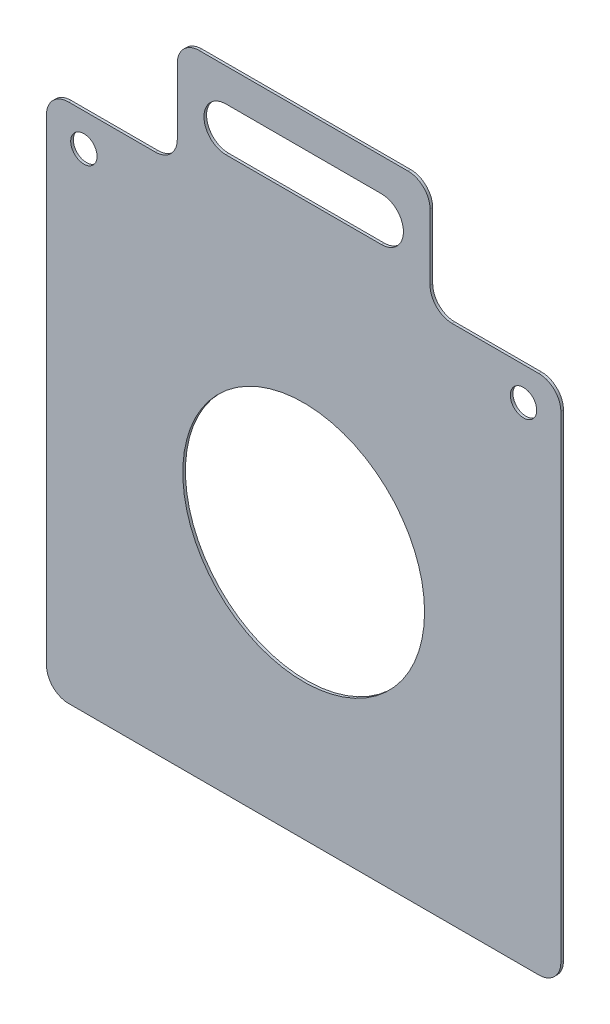
ISO-10303-21;
HEADER;
FILE_DESCRIPTION(('STEP AP214'),'2;1');
FILE_NAME('part.step','',(''),(''),'','','');
FILE_SCHEMA(('AUTOMOTIVE_DESIGN { 1 0 10303 214 1 1 1 1 }'));
ENDSEC;
DATA;
#1=APPLICATION_CONTEXT('core data for automotive mechanical design processes');
#2=APPLICATION_PROTOCOL_DEFINITION('international standard','automotive_design',2000,#1);
#3=PRODUCT_CONTEXT('',#1,'mechanical');
#4=PRODUCT('Part','Part','',(#3));
#5=PRODUCT_RELATED_PRODUCT_CATEGORY('part','',(#4));
#6=PRODUCT_DEFINITION_FORMATION('','',#4);
#7=PRODUCT_DEFINITION_CONTEXT('part definition',#1,'design');
#8=PRODUCT_DEFINITION('design','',#6,#7);
#9=PRODUCT_DEFINITION_SHAPE('','',#8);
#10=(LENGTH_UNIT() NAMED_UNIT(*) SI_UNIT(.MILLI.,.METRE.));
#11=(NAMED_UNIT(*) PLANE_ANGLE_UNIT() SI_UNIT($,.RADIAN.));
#12=(NAMED_UNIT(*) SI_UNIT($,.STERADIAN.) SOLID_ANGLE_UNIT());
#13=UNCERTAINTY_MEASURE_WITH_UNIT(LENGTH_MEASURE(1.E-05),#10,'distance_accuracy_value','');
#14=(GEOMETRIC_REPRESENTATION_CONTEXT(3) GLOBAL_UNCERTAINTY_ASSIGNED_CONTEXT((#13)) GLOBAL_UNIT_ASSIGNED_CONTEXT((#10,
#11,#12)) REPRESENTATION_CONTEXT('',''));
#15=CARTESIAN_POINT('',(0.,0.,0.));
#16=DIRECTION('',(0.,0.,1.));
#17=DIRECTION('',(1.,0.,0.));
#18=AXIS2_PLACEMENT_3D('',#15,#16,#17);
#19=CARTESIAN_POINT('',(-117.,120.,1.20000000000002));
#20=DIRECTION('',(0.,-1.,0.));
#21=DIRECTION('',(1.,0.,0.));
#22=AXIS2_PLACEMENT_3D('',#19,#20,#21);
#23=PLANE('',#22);
#24=DIRECTION('',(-1.,0.,0.));
#25=VECTOR('',#24,1.);
#26=CARTESIAN_POINT('',(-117.,120.,1.20000000000002));
#27=LINE('',#26,#25);
#28=CARTESIAN_POINT('',(-67.5000000000001,120.,1.20000000000002));
#29=VERTEX_POINT('',#28);
#30=CARTESIAN_POINT('',(-107.,120.,1.20000000000002));
#31=VERTEX_POINT('',#30);
#32=EDGE_CURVE('E276',#29,#31,#27,.T.);
#33=ORIENTED_EDGE('',*,*,#32,.F.);
#34=DIRECTION('',(0.,0.,1.));
#35=VECTOR('',#34,1.);
#36=CARTESIAN_POINT('',(-67.5000000000001,120.,1.20000000000002));
#37=LINE('',#36,#35);
#38=CARTESIAN_POINT('',(-67.5000000000001,120.,0.));
#39=VERTEX_POINT('',#38);
#40=EDGE_CURVE('E361',#29,#39,#37,.F.);
#41=ORIENTED_EDGE('',*,*,#40,.T.);
#42=DIRECTION('',(-1.,0.,0.));
#43=VECTOR('',#42,1.);
#44=CARTESIAN_POINT('',(-117.,120.,0.));
#45=LINE('',#44,#43);
#46=CARTESIAN_POINT('',(-107.,120.,0.));
#47=VERTEX_POINT('',#46);
#48=EDGE_CURVE('E291',#39,#47,#45,.T.);
#49=ORIENTED_EDGE('',*,*,#48,.T.);
#50=DIRECTION('',(0.,0.,-1.));
#51=VECTOR('',#50,1.);
#52=CARTESIAN_POINT('',(-107.,120.,1.20000000000002));
#53=LINE('',#52,#51);
#54=EDGE_CURVE('E358',#47,#31,#53,.F.);
#55=ORIENTED_EDGE('',*,*,#54,.T.);
#56=EDGE_LOOP('',(#33,#41,#49,#55));
#57=FACE_BOUND('',#56,.T.);
#58=ADVANCED_FACE('F40',(#57),#23,.F.);
#59=CARTESIAN_POINT('',(0.,0.,1.20000000000001));
#60=DIRECTION('',(0.,0.,1.));
#61=DIRECTION('',(1.,0.,0.));
#62=AXIS2_PLACEMENT_3D('',#59,#60,#61);
#63=PLANE('',#62);
#64=CARTESIAN_POINT('',(-100.,105.,1.20000000000002));
#65=DIRECTION('',(0.,0.,1.));
#66=DIRECTION('',(1.,0.,0.));
#67=AXIS2_PLACEMENT_3D('',#64,#65,#66);
#68=CIRCLE('',#67,6.);
#69=CARTESIAN_POINT('',(-94.0000000000003,105.,1.20000000000002));
#70=VERTEX_POINT('',#69);
#71=EDGE_CURVE('E247',#70,#70,#68,.T.);
#72=ORIENTED_EDGE('',*,*,#71,.F.);
#73=EDGE_LOOP('',(#72));
#74=FACE_BOUND('',#73,.T.);
#75=DIRECTION('',(0.,1.,0.));
#76=VECTOR('',#75,1.);
#77=CARTESIAN_POINT('',(57.5000000000002,170.000000000002,1.20000000000003));
#78=LINE('',#77,#76);
#79=CARTESIAN_POINT('',(57.5000000000002,130.000000000001,1.20000000000003));
#80=VERTEX_POINT('',#79);
#81=CARTESIAN_POINT('',(57.5000000000001,160.000000000002,1.20000000000003));
#82=VERTEX_POINT('',#81);
#83=EDGE_CURVE('E217',#80,#82,#78,.T.);
#84=ORIENTED_EDGE('',*,*,#83,.T.);
#85=CARTESIAN_POINT('',(47.5,160.000000000002,1.20000000000003));
#86=DIRECTION('',(0.,0.,1.));
#87=DIRECTION('',(1.,0.,0.));
#88=AXIS2_PLACEMENT_3D('',#85,#86,#87);
#89=CIRCLE('',#88,10.);
#90=CARTESIAN_POINT('',(47.5000000000002,170.000000000002,1.20000000000003));
#91=VERTEX_POINT('',#90);
#92=EDGE_CURVE('E325',#82,#91,#89,.T.);
#93=ORIENTED_EDGE('',*,*,#92,.T.);
#94=DIRECTION('',(-1.,0.,0.));
#95=VECTOR('',#94,1.);
#96=CARTESIAN_POINT('',(-57.5,170.000000000002,1.20000000000002));
#97=LINE('',#96,#95);
#98=CARTESIAN_POINT('',(-47.5000000000002,170.000000000002,1.20000000000002));
#99=VERTEX_POINT('',#98);
#100=EDGE_CURVE('E225',#91,#99,#97,.T.);
#101=ORIENTED_EDGE('',*,*,#100,.T.);
#102=CARTESIAN_POINT('',(-47.5,160.000000000002,1.20000000000003));
#103=DIRECTION('',(0.,0.,1.));
#104=DIRECTION('',(1.,0.,0.));
#105=AXIS2_PLACEMENT_3D('',#102,#103,#104);
#106=CIRCLE('',#105,10.);
#107=CARTESIAN_POINT('',(-57.5000000000002,160.000000000002,1.20000000000002));
#108=VERTEX_POINT('',#107);
#109=EDGE_CURVE('E322',#99,#108,#106,.T.);
#110=ORIENTED_EDGE('',*,*,#109,.T.);
#111=DIRECTION('',(0.,-1.,0.));
#112=VECTOR('',#111,1.);
#113=CARTESIAN_POINT('',(-57.5,120.000000000002,1.20000000000002));
#114=LINE('',#113,#112);
#115=CARTESIAN_POINT('',(-57.5000000000002,130.,1.20000000000001));
#116=VERTEX_POINT('',#115);
#117=EDGE_CURVE('E229',#108,#116,#114,.T.);
#118=ORIENTED_EDGE('',*,*,#117,.T.);
#119=CARTESIAN_POINT('',(-67.5000000000001,130.,1.20000000000001));
#120=DIRECTION('',(0.,0.,1.));
#121=DIRECTION('',(1.,0.,0.));
#122=AXIS2_PLACEMENT_3D('',#119,#120,#121);
#123=CIRCLE('',#122,10.);
#124=EDGE_CURVE('E49',#116,#29,#123,.F.);
#125=ORIENTED_EDGE('',*,*,#124,.T.);
#126=ORIENTED_EDGE('',*,*,#32,.T.);
#127=CARTESIAN_POINT('',(-107.,110.,1.20000000000002));
#128=DIRECTION('',(0.,0.,1.));
#129=DIRECTION('',(1.,0.,0.));
#130=AXIS2_PLACEMENT_3D('',#127,#128,#129);
#131=CIRCLE('',#130,10.);
#132=CARTESIAN_POINT('',(-117.,110.,1.20000000000002));
#133=VERTEX_POINT('',#132);
#134=EDGE_CURVE('E319',#31,#133,#131,.T.);
#135=ORIENTED_EDGE('',*,*,#134,.T.);
#136=DIRECTION('',(0.,-1.,0.));
#137=VECTOR('',#136,1.);
#138=CARTESIAN_POINT('',(-117.,120.,1.20000000000002));
#139=LINE('',#138,#137);
#140=CARTESIAN_POINT('',(-117.,-107.,1.19999999999999));
#141=VERTEX_POINT('',#140);
#142=EDGE_CURVE('E263',#133,#141,#139,.T.);
#143=ORIENTED_EDGE('',*,*,#142,.T.);
#144=CARTESIAN_POINT('',(-107.,-107.,1.19999999999999));
#145=DIRECTION('',(0.,0.,1.));
#146=DIRECTION('',(1.,0.,0.));
#147=AXIS2_PLACEMENT_3D('',#144,#145,#146);
#148=CIRCLE('',#147,10.);
#149=CARTESIAN_POINT('',(-107.,-117.,1.19999999999999));
#150=VERTEX_POINT('',#149);
#151=EDGE_CURVE('E313',#141,#150,#148,.T.);
#152=ORIENTED_EDGE('',*,*,#151,.T.);
#153=DIRECTION('',(1.,0.,0.));
#154=VECTOR('',#153,1.);
#155=CARTESIAN_POINT('',(-117.,-117.,1.19999999999999));
#156=LINE('',#155,#154);
#157=CARTESIAN_POINT('',(107.,-117.,1.20000000000001));
#158=VERTEX_POINT('',#157);
#159=EDGE_CURVE('E267',#150,#158,#156,.T.);
#160=ORIENTED_EDGE('',*,*,#159,.T.);
#161=CARTESIAN_POINT('',(107.,-107.,1.20000000000001));
#162=DIRECTION('',(0.,0.,1.));
#163=DIRECTION('',(1.,0.,0.));
#164=AXIS2_PLACEMENT_3D('',#161,#162,#163);
#165=CIRCLE('',#164,10.);
#166=CARTESIAN_POINT('',(117.,-107.,1.20000000000001));
#167=VERTEX_POINT('',#166);
#168=EDGE_CURVE('E316',#158,#167,#165,.T.);
#169=ORIENTED_EDGE('',*,*,#168,.T.);
#170=DIRECTION('',(0.,1.,0.));
#171=VECTOR('',#170,1.);
#172=CARTESIAN_POINT('',(117.,120.,1.20000000000001));
#173=LINE('',#172,#171);
#174=CARTESIAN_POINT('',(117.,110.,1.20000000000001));
#175=VERTEX_POINT('',#174);
#176=EDGE_CURVE('E272',#167,#175,#173,.T.);
#177=ORIENTED_EDGE('',*,*,#176,.T.);
#178=CARTESIAN_POINT('',(107.,110.,1.20000000000001));
#179=DIRECTION('',(0.,0.,1.));
#180=DIRECTION('',(1.,0.,0.));
#181=AXIS2_PLACEMENT_3D('',#178,#179,#180);
#182=CIRCLE('',#181,10.);
#183=CARTESIAN_POINT('',(107.,120.,1.20000000000001));
#184=VERTEX_POINT('',#183);
#185=EDGE_CURVE('E310',#175,#184,#182,.T.);
#186=ORIENTED_EDGE('',*,*,#185,.T.);
#187=CARTESIAN_POINT('',(67.5,120.000000000001,1.20000000000001));
#188=VERTEX_POINT('',#187);
#189=EDGE_CURVE('E280',#184,#188,#27,.T.);
#190=ORIENTED_EDGE('',*,*,#189,.T.);
#191=CARTESIAN_POINT('',(67.5000000000002,130.000000000001,1.20000000000001));
#192=DIRECTION('',(0.,0.,1.));
#193=DIRECTION('',(1.,0.,0.));
#194=AXIS2_PLACEMENT_3D('',#191,#192,#193);
#195=CIRCLE('',#194,10.);
#196=EDGE_CURVE('E384',#188,#80,#195,.F.);
#197=ORIENTED_EDGE('',*,*,#196,.T.);
#198=EDGE_LOOP('',(#84,#93,#101,#110,#118,#125,#126,#135,#143,#152,#160,#169,#177,#186,#190,#197));
#199=FACE_BOUND('',#198,.T.);
#200=CARTESIAN_POINT('',(0.,0.,1.20000000000001));
#201=DIRECTION('',(0.,0.,1.));
#202=DIRECTION('',(1.,0.,0.));
#203=AXIS2_PLACEMENT_3D('',#200,#201,#202);
#204=CIRCLE('',#203,55.);
#205=CARTESIAN_POINT('',(55.0000000000001,0.,1.20000000000001));
#206=VERTEX_POINT('',#205);
#207=EDGE_CURVE('E255',#206,#206,#204,.T.);
#208=ORIENTED_EDGE('',*,*,#207,.F.);
#209=EDGE_LOOP('',(#208));
#210=FACE_BOUND('',#209,.T.);
#211=CARTESIAN_POINT('',(100.,105.,1.20000000000001));
#212=DIRECTION('',(0.,0.,1.));
#213=DIRECTION('',(-1.,0.,0.));
#214=AXIS2_PLACEMENT_3D('',#211,#212,#213);
#215=CIRCLE('',#214,6.);
#216=CARTESIAN_POINT('',(94.0000000000001,105.,1.20000000000001));
#217=VERTEX_POINT('',#216);
#218=EDGE_CURVE('E237',#217,#217,#215,.T.);
#219=ORIENTED_EDGE('',*,*,#218,.F.);
#220=EDGE_LOOP('',(#219));
#221=FACE_BOUND('',#220,.T.);
#222=DIRECTION('',(1.,0.,0.));
#223=VECTOR('',#222,1.);
#224=CARTESIAN_POINT('',(-35.3706002300002,134.999999999999,1.20000000000002));
#225=LINE('',#224,#223);
#226=CARTESIAN_POINT('',(-35.3706002300002,134.999999999999,1.20000000000002));
#227=VERTEX_POINT('',#226);
#228=CARTESIAN_POINT('',(35.3706002300002,135.,1.20000000000001));
#229=VERTEX_POINT('',#228);
#230=EDGE_CURVE('E195',#227,#229,#225,.T.);
#231=ORIENTED_EDGE('',*,*,#230,.F.);
#232=CARTESIAN_POINT('',(-35.3706002300002,145.000000000002,1.20000000000002));
#233=DIRECTION('',(0.,0.,1.));
#234=DIRECTION('',(1.,0.,0.));
#235=AXIS2_PLACEMENT_3D('',#232,#233,#234);
#236=CIRCLE('',#235,10.0000000000015);
#237=CARTESIAN_POINT('',(-35.3706002300001,155.000000000002,1.20000000000002));
#238=VERTEX_POINT('',#237);
#239=EDGE_CURVE('E202',#238,#227,#236,.T.);
#240=ORIENTED_EDGE('',*,*,#239,.F.);
#241=DIRECTION('',(-1.,0.,0.));
#242=VECTOR('',#241,1.);
#243=CARTESIAN_POINT('',(-35.3706002300001,155.000000000002,1.20000000000002));
#244=LINE('',#243,#242);
#245=CARTESIAN_POINT('',(35.3706002300002,155.000000000002,1.20000000000003));
#246=VERTEX_POINT('',#245);
#247=EDGE_CURVE('E206',#246,#238,#244,.T.);
#248=ORIENTED_EDGE('',*,*,#247,.F.);
#249=CARTESIAN_POINT('',(35.3706002300001,145.000000000002,1.20000000000001));
#250=DIRECTION('',(0.,0.,1.));
#251=DIRECTION('',(1.,0.,0.));
#252=AXIS2_PLACEMENT_3D('',#249,#250,#251);
#253=CIRCLE('',#252,10.0000000000015);
#254=EDGE_CURVE('E185',#229,#246,#253,.T.);
#255=ORIENTED_EDGE('',*,*,#254,.F.);
#256=EDGE_LOOP('',(#231,#240,#248,#255));
#257=FACE_BOUND('',#256,.T.);
#258=ADVANCED_FACE('F204',(#74,#199,#210,#221,#257),#63,.T.);
#259=CARTESIAN_POINT('',(0.,0.,0.));
#260=DIRECTION('',(0.,0.,1.));
#261=DIRECTION('',(1.,0.,0.));
#262=AXIS2_PLACEMENT_3D('',#259,#260,#261);
#263=PLANE('',#262);
#264=DIRECTION('',(1.,0.,0.));
#265=VECTOR('',#264,1.);
#266=CARTESIAN_POINT('',(-57.5,170.000000000002,0.));
#267=LINE('',#266,#265);
#268=CARTESIAN_POINT('',(-47.5000000000002,170.000000000002,0.));
#269=VERTEX_POINT('',#268);
#270=CARTESIAN_POINT('',(47.5000000000002,170.000000000002,0.));
#271=VERTEX_POINT('',#270);
#272=EDGE_CURVE('E236',#269,#271,#267,.T.);
#273=ORIENTED_EDGE('',*,*,#272,.T.);
#274=CARTESIAN_POINT('',(47.5,160.000000000002,0.));
#275=DIRECTION('',(0.,0.,1.));
#276=DIRECTION('',(1.,0.,0.));
#277=AXIS2_PLACEMENT_3D('',#274,#275,#276);
#278=CIRCLE('',#277,10.);
#279=CARTESIAN_POINT('',(57.5000000000001,160.000000000002,0.));
#280=VERTEX_POINT('',#279);
#281=EDGE_CURVE('E348',#271,#280,#278,.F.);
#282=ORIENTED_EDGE('',*,*,#281,.T.);
#283=DIRECTION('',(0.,-1.,0.));
#284=VECTOR('',#283,1.);
#285=CARTESIAN_POINT('',(57.5000000000002,170.000000000002,0.));
#286=LINE('',#285,#284);
#287=CARTESIAN_POINT('',(57.5000000000002,130.000000000001,0.));
#288=VERTEX_POINT('',#287);
#289=EDGE_CURVE('E246',#280,#288,#286,.T.);
#290=ORIENTED_EDGE('',*,*,#289,.T.);
#291=CARTESIAN_POINT('',(67.5000000000002,130.000000000001,0.));
#292=DIRECTION('',(0.,0.,1.));
#293=DIRECTION('',(1.,0.,0.));
#294=AXIS2_PLACEMENT_3D('',#291,#292,#293);
#295=CIRCLE('',#294,10.);
#296=CARTESIAN_POINT('',(67.5,120.000000000001,0.));
#297=VERTEX_POINT('',#296);
#298=EDGE_CURVE('E387',#288,#297,#295,.T.);
#299=ORIENTED_EDGE('',*,*,#298,.T.);
#300=CARTESIAN_POINT('',(107.,120.,0.));
#301=VERTEX_POINT('',#300);
#302=EDGE_CURVE('E268',#301,#297,#45,.T.);
#303=ORIENTED_EDGE('',*,*,#302,.F.);
#304=CARTESIAN_POINT('',(107.,110.,0.));
#305=DIRECTION('',(0.,0.,1.));
#306=DIRECTION('',(1.,0.,0.));
#307=AXIS2_PLACEMENT_3D('',#304,#305,#306);
#308=CIRCLE('',#307,10.);
#309=CARTESIAN_POINT('',(117.,110.,0.));
#310=VERTEX_POINT('',#309);
#311=EDGE_CURVE('E335',#301,#310,#308,.F.);
#312=ORIENTED_EDGE('',*,*,#311,.T.);
#313=DIRECTION('',(0.,1.,0.));
#314=VECTOR('',#313,1.);
#315=CARTESIAN_POINT('',(117.,120.,0.));
#316=LINE('',#315,#314);
#317=CARTESIAN_POINT('',(117.,-107.,0.));
#318=VERTEX_POINT('',#317);
#319=EDGE_CURVE('E287',#318,#310,#316,.T.);
#320=ORIENTED_EDGE('',*,*,#319,.F.);
#321=CARTESIAN_POINT('',(107.,-107.,0.));
#322=DIRECTION('',(0.,0.,1.));
#323=DIRECTION('',(1.,0.,0.));
#324=AXIS2_PLACEMENT_3D('',#321,#322,#323);
#325=CIRCLE('',#324,10.);
#326=CARTESIAN_POINT('',(107.,-117.,0.));
#327=VERTEX_POINT('',#326);
#328=EDGE_CURVE('E56',#318,#327,#325,.F.);
#329=ORIENTED_EDGE('',*,*,#328,.T.);
#330=DIRECTION('',(1.,0.,0.));
#331=VECTOR('',#330,1.);
#332=CARTESIAN_POINT('',(-117.,-117.,0.));
#333=LINE('',#332,#331);
#334=CARTESIAN_POINT('',(-107.,-117.,0.));
#335=VERTEX_POINT('',#334);
#336=EDGE_CURVE('E284',#335,#327,#333,.T.);
#337=ORIENTED_EDGE('',*,*,#336,.F.);
#338=CARTESIAN_POINT('',(-107.,-107.,0.));
#339=DIRECTION('',(0.,0.,1.));
#340=DIRECTION('',(1.,0.,0.));
#341=AXIS2_PLACEMENT_3D('',#338,#339,#340);
#342=CIRCLE('',#341,10.);
#343=CARTESIAN_POINT('',(-117.,-107.,0.));
#344=VERTEX_POINT('',#343);
#345=EDGE_CURVE('E64',#335,#344,#342,.F.);
#346=ORIENTED_EDGE('',*,*,#345,.T.);
#347=DIRECTION('',(0.,-1.,0.));
#348=VECTOR('',#347,1.);
#349=CARTESIAN_POINT('',(-117.,120.,0.));
#350=LINE('',#349,#348);
#351=CARTESIAN_POINT('',(-117.,110.,0.));
#352=VERTEX_POINT('',#351);
#353=EDGE_CURVE('E259',#352,#344,#350,.T.);
#354=ORIENTED_EDGE('',*,*,#353,.F.);
#355=CARTESIAN_POINT('',(-107.,110.,0.));
#356=DIRECTION('',(0.,0.,1.));
#357=DIRECTION('',(1.,0.,0.));
#358=AXIS2_PLACEMENT_3D('',#355,#356,#357);
#359=CIRCLE('',#358,10.);
#360=EDGE_CURVE('E342',#352,#47,#359,.F.);
#361=ORIENTED_EDGE('',*,*,#360,.T.);
#362=ORIENTED_EDGE('',*,*,#48,.F.);
#363=CARTESIAN_POINT('',(-67.5000000000001,130.,0.));
#364=DIRECTION('',(0.,0.,1.));
#365=DIRECTION('',(1.,0.,0.));
#366=AXIS2_PLACEMENT_3D('',#363,#364,#365);
#367=CIRCLE('',#366,10.);
#368=CARTESIAN_POINT('',(-57.5000000000002,130.,0.));
#369=VERTEX_POINT('',#368);
#370=EDGE_CURVE('E11',#39,#369,#367,.T.);
#371=ORIENTED_EDGE('',*,*,#370,.T.);
#372=DIRECTION('',(0.,1.,0.));
#373=VECTOR('',#372,1.);
#374=CARTESIAN_POINT('',(-57.5,120.000000000002,0.));
#375=LINE('',#374,#373);
#376=CARTESIAN_POINT('',(-57.5000000000002,160.000000000002,0.));
#377=VERTEX_POINT('',#376);
#378=EDGE_CURVE('E410',#369,#377,#375,.T.);
#379=ORIENTED_EDGE('',*,*,#378,.T.);
#380=CARTESIAN_POINT('',(-47.5,160.000000000002,0.));
#381=DIRECTION('',(0.,0.,1.));
#382=DIRECTION('',(1.,0.,0.));
#383=AXIS2_PLACEMENT_3D('',#380,#381,#382);
#384=CIRCLE('',#383,10.);
#385=EDGE_CURVE('E345',#377,#269,#384,.F.);
#386=ORIENTED_EDGE('',*,*,#385,.T.);
#387=EDGE_LOOP('',(#273,#282,#290,#299,#303,#312,#320,#329,#337,#346,#354,#361,#362,#371,#379,#386));
#388=FACE_BOUND('',#387,.T.);
#389=CARTESIAN_POINT('',(0.,0.,0.));
#390=DIRECTION('',(0.,0.,1.));
#391=DIRECTION('',(1.,0.,0.));
#392=AXIS2_PLACEMENT_3D('',#389,#390,#391);
#393=CIRCLE('',#392,55.);
#394=CARTESIAN_POINT('',(55.0000000000001,0.,0.));
#395=VERTEX_POINT('',#394);
#396=EDGE_CURVE('E251',#395,#395,#393,.T.);
#397=ORIENTED_EDGE('',*,*,#396,.T.);
#398=EDGE_LOOP('',(#397));
#399=FACE_BOUND('',#398,.T.);
#400=CARTESIAN_POINT('',(-100.,105.,0.));
#401=DIRECTION('',(0.,0.,1.));
#402=DIRECTION('',(1.,0.,0.));
#403=AXIS2_PLACEMENT_3D('',#400,#401,#402);
#404=CIRCLE('',#403,6.);
#405=CARTESIAN_POINT('',(-94.0000000000003,105.,0.));
#406=VERTEX_POINT('',#405);
#407=EDGE_CURVE('E241',#406,#406,#404,.T.);
#408=ORIENTED_EDGE('',*,*,#407,.T.);
#409=EDGE_LOOP('',(#408));
#410=FACE_BOUND('',#409,.T.);
#411=CARTESIAN_POINT('',(100.,105.,0.));
#412=DIRECTION('',(0.,0.,1.));
#413=DIRECTION('',(-1.,0.,0.));
#414=AXIS2_PLACEMENT_3D('',#411,#412,#413);
#415=CIRCLE('',#414,6.);
#416=CARTESIAN_POINT('',(94.0000000000001,105.,0.));
#417=VERTEX_POINT('',#416);
#418=EDGE_CURVE('E242',#417,#417,#415,.T.);
#419=ORIENTED_EDGE('',*,*,#418,.T.);
#420=EDGE_LOOP('',(#419));
#421=FACE_BOUND('',#420,.T.);
#422=DIRECTION('',(-1.,0.,0.));
#423=VECTOR('',#422,1.);
#424=CARTESIAN_POINT('',(-35.3706002300002,134.999999999999,0.));
#425=LINE('',#424,#423);
#426=CARTESIAN_POINT('',(35.37060023,134.999999999999,0.));
#427=VERTEX_POINT('',#426);
#428=CARTESIAN_POINT('',(-35.3706002300002,134.999999999999,0.));
#429=VERTEX_POINT('',#428);
#430=EDGE_CURVE('E233',#427,#429,#425,.T.);
#431=ORIENTED_EDGE('',*,*,#430,.F.);
#432=CARTESIAN_POINT('',(35.3706002300001,145.000000000002,0.));
#433=DIRECTION('',(0.,0.,1.));
#434=DIRECTION('',(1.,0.,0.));
#435=AXIS2_PLACEMENT_3D('',#432,#433,#434);
#436=CIRCLE('',#435,10.0000000000015);
#437=CARTESIAN_POINT('',(35.37060023,155.000000000004,0.));
#438=VERTEX_POINT('',#437);
#439=EDGE_CURVE('E187',#438,#427,#436,.F.);
#440=ORIENTED_EDGE('',*,*,#439,.F.);
#441=DIRECTION('',(1.,0.,0.));
#442=VECTOR('',#441,1.);
#443=CARTESIAN_POINT('',(-35.3706002300001,155.000000000002,0.));
#444=LINE('',#443,#442);
#445=CARTESIAN_POINT('',(-35.3706002300001,155.000000000002,0.));
#446=VERTEX_POINT('',#445);
#447=EDGE_CURVE('E420',#446,#438,#444,.T.);
#448=ORIENTED_EDGE('',*,*,#447,.F.);
#449=CARTESIAN_POINT('',(-35.3706002300002,145.000000000002,0.));
#450=DIRECTION('',(0.,0.,1.));
#451=DIRECTION('',(1.,0.,0.));
#452=AXIS2_PLACEMENT_3D('',#449,#450,#451);
#453=CIRCLE('',#452,10.0000000000015);
#454=EDGE_CURVE('E415',#429,#446,#453,.F.);
#455=ORIENTED_EDGE('',*,*,#454,.F.);
#456=EDGE_LOOP('',(#431,#440,#448,#455));
#457=FACE_BOUND('',#456,.T.);
#458=ADVANCED_FACE('F408',(#388,#399,#410,#421,#457),#263,.F.);
#459=CARTESIAN_POINT('',(-117.,120.,1.20000000000002));
#460=DIRECTION('',(1.,0.,0.));
#461=DIRECTION('',(0.,1.,0.));
#462=AXIS2_PLACEMENT_3D('',#459,#460,#461);
#463=PLANE('',#462);
#464=ORIENTED_EDGE('',*,*,#142,.F.);
#465=DIRECTION('',(0.,0.,-1.));
#466=VECTOR('',#465,1.);
#467=CARTESIAN_POINT('',(-117.,110.,1.20000000000002));
#468=LINE('',#467,#466);
#469=EDGE_CURVE('E367',#133,#352,#468,.T.);
#470=ORIENTED_EDGE('',*,*,#469,.T.);
#471=ORIENTED_EDGE('',*,*,#353,.T.);
#472=DIRECTION('',(0.,0.,-1.));
#473=VECTOR('',#472,1.);
#474=CARTESIAN_POINT('',(-117.,-107.,1.19999999999999));
#475=LINE('',#474,#473);
#476=EDGE_CURVE('E364',#344,#141,#475,.F.);
#477=ORIENTED_EDGE('',*,*,#476,.T.);
#478=EDGE_LOOP('',(#464,#470,#471,#477));
#479=FACE_BOUND('',#478,.T.);
#480=ADVANCED_FACE('F482',(#479),#463,.F.);
#481=CARTESIAN_POINT('',(-117.,-117.,1.19999999999999));
#482=DIRECTION('',(0.,1.,0.));
#483=DIRECTION('',(-1.,0.,0.));
#484=AXIS2_PLACEMENT_3D('',#481,#482,#483);
#485=PLANE('',#484);
#486=ORIENTED_EDGE('',*,*,#336,.T.);
#487=DIRECTION('',(0.,0.,-1.));
#488=VECTOR('',#487,1.);
#489=CARTESIAN_POINT('',(107.,-117.,1.20000000000001));
#490=LINE('',#489,#488);
#491=EDGE_CURVE('E381',#327,#158,#490,.F.);
#492=ORIENTED_EDGE('',*,*,#491,.T.);
#493=ORIENTED_EDGE('',*,*,#159,.F.);
#494=DIRECTION('',(0.,0.,-1.));
#495=VECTOR('',#494,1.);
#496=CARTESIAN_POINT('',(-107.,-117.,1.19999999999999));
#497=LINE('',#496,#495);
#498=EDGE_CURVE('E378',#150,#335,#497,.T.);
#499=ORIENTED_EDGE('',*,*,#498,.T.);
#500=EDGE_LOOP('',(#486,#492,#493,#499));
#501=FACE_BOUND('',#500,.T.);
#502=ADVANCED_FACE('F476',(#501),#485,.F.);
#503=CARTESIAN_POINT('',(117.,120.,1.20000000000001));
#504=DIRECTION('',(-1.,0.,0.));
#505=DIRECTION('',(0.,-1.,0.));
#506=AXIS2_PLACEMENT_3D('',#503,#504,#505);
#507=PLANE('',#506);
#508=ORIENTED_EDGE('',*,*,#176,.F.);
#509=DIRECTION('',(0.,0.,-1.));
#510=VECTOR('',#509,1.);
#511=CARTESIAN_POINT('',(117.,-107.,1.20000000000001));
#512=LINE('',#511,#510);
#513=EDGE_CURVE('E374',#167,#318,#512,.T.);
#514=ORIENTED_EDGE('',*,*,#513,.T.);
#515=ORIENTED_EDGE('',*,*,#319,.T.);
#516=DIRECTION('',(0.,0.,-1.));
#517=VECTOR('',#516,1.);
#518=CARTESIAN_POINT('',(117.,110.,1.20000000000001));
#519=LINE('',#518,#517);
#520=EDGE_CURVE('E371',#310,#175,#519,.F.);
#521=ORIENTED_EDGE('',*,*,#520,.T.);
#522=EDGE_LOOP('',(#508,#514,#515,#521));
#523=FACE_BOUND('',#522,.T.);
#524=ADVANCED_FACE('F468',(#523),#507,.F.);
#525=ORIENTED_EDGE('',*,*,#302,.T.);
#526=DIRECTION('',(0.,0.,1.));
#527=VECTOR('',#526,1.);
#528=CARTESIAN_POINT('',(67.5000000000002,120.,1.20000000000001));
#529=LINE('',#528,#527);
#530=EDGE_CURVE('E299',#297,#188,#529,.T.);
#531=ORIENTED_EDGE('',*,*,#530,.T.);
#532=ORIENTED_EDGE('',*,*,#189,.F.);
#533=DIRECTION('',(0.,0.,-1.));
#534=VECTOR('',#533,1.);
#535=CARTESIAN_POINT('',(107.,120.,1.20000000000001));
#536=LINE('',#535,#534);
#537=EDGE_CURVE('E295',#184,#301,#536,.T.);
#538=ORIENTED_EDGE('',*,*,#537,.T.);
#539=EDGE_LOOP('',(#525,#531,#532,#538));
#540=FACE_BOUND('',#539,.T.);
#541=ADVANCED_FACE('F457',(#540),#23,.F.);
#542=CARTESIAN_POINT('',(0.,0.,1.20000000000001));
#543=DIRECTION('',(0.,0.,-1.));
#544=DIRECTION('',(-1.,0.,0.));
#545=AXIS2_PLACEMENT_3D('',#542,#543,#544);
#546=CYLINDRICAL_SURFACE('',#545,55.);
#547=ORIENTED_EDGE('',*,*,#207,.T.);
#548=EDGE_LOOP('',(#547));
#549=FACE_BOUND('',#548,.T.);
#550=ORIENTED_EDGE('',*,*,#396,.F.);
#551=EDGE_LOOP('',(#550));
#552=FACE_BOUND('',#551,.T.);
#553=ADVANCED_FACE('F505',(#549,#552),#546,.F.);
#554=CARTESIAN_POINT('',(-100.,105.,1.20000000000002));
#555=DIRECTION('',(0.,0.,-1.));
#556=DIRECTION('',(-1.,0.,0.));
#557=AXIS2_PLACEMENT_3D('',#554,#555,#556);
#558=CYLINDRICAL_SURFACE('',#557,6.);
#559=ORIENTED_EDGE('',*,*,#71,.T.);
#560=EDGE_LOOP('',(#559));
#561=FACE_BOUND('',#560,.T.);
#562=ORIENTED_EDGE('',*,*,#407,.F.);
#563=EDGE_LOOP('',(#562));
#564=FACE_BOUND('',#563,.T.);
#565=ADVANCED_FACE('F510',(#561,#564),#558,.F.);
#566=CARTESIAN_POINT('',(100.,105.,1.20000000000001));
#567=DIRECTION('',(0.,0.,-1.));
#568=DIRECTION('',(-1.,0.,0.));
#569=AXIS2_PLACEMENT_3D('',#566,#567,#568);
#570=CYLINDRICAL_SURFACE('',#569,6.);
#571=ORIENTED_EDGE('',*,*,#218,.T.);
#572=EDGE_LOOP('',(#571));
#573=FACE_BOUND('',#572,.T.);
#574=ORIENTED_EDGE('',*,*,#418,.F.);
#575=EDGE_LOOP('',(#574));
#576=FACE_BOUND('',#575,.T.);
#577=ADVANCED_FACE('F538',(#573,#576),#570,.F.);
#578=CARTESIAN_POINT('',(57.5000000000002,170.000000000002,-125.399362039844));
#579=DIRECTION('',(1.,0.,0.));
#580=DIRECTION('',(0.,1.,0.));
#581=AXIS2_PLACEMENT_3D('',#578,#579,#580);
#582=PLANE('',#581);
#583=ORIENTED_EDGE('',*,*,#83,.F.);
#584=DIRECTION('',(0.,0.,1.));
#585=VECTOR('',#584,1.);
#586=CARTESIAN_POINT('',(57.5000000000002,130.000000000001,-125.399362039844));
#587=LINE('',#586,#585);
#588=EDGE_CURVE('E307',#80,#288,#587,.F.);
#589=ORIENTED_EDGE('',*,*,#588,.T.);
#590=ORIENTED_EDGE('',*,*,#289,.F.);
#591=DIRECTION('',(0.,0.,1.));
#592=VECTOR('',#591,1.);
#593=CARTESIAN_POINT('',(57.5000000000001,160.000000000002,-125.399362039844));
#594=LINE('',#593,#592);
#595=EDGE_CURVE('E303',#280,#82,#594,.T.);
#596=ORIENTED_EDGE('',*,*,#595,.T.);
#597=EDGE_LOOP('',(#583,#589,#590,#596));
#598=FACE_BOUND('',#597,.T.);
#599=ADVANCED_FACE('F536',(#598),#582,.T.);
#600=CARTESIAN_POINT('',(-57.5000000000001,170.000000000002,-125.399362039845));
#601=DIRECTION('',(0.,1.,0.));
#602=DIRECTION('',(0.,0.,1.));
#603=AXIS2_PLACEMENT_3D('',#600,#601,#602);
#604=PLANE('',#603);
#605=ORIENTED_EDGE('',*,*,#100,.F.);
#606=DIRECTION('',(0.,0.,1.));
#607=VECTOR('',#606,1.);
#608=CARTESIAN_POINT('',(47.5000000000002,170.000000000002,-125.399362039844));
#609=LINE('',#608,#607);
#610=EDGE_CURVE('E332',#91,#271,#609,.F.);
#611=ORIENTED_EDGE('',*,*,#610,.T.);
#612=ORIENTED_EDGE('',*,*,#272,.F.);
#613=DIRECTION('',(0.,0.,1.));
#614=VECTOR('',#613,1.);
#615=CARTESIAN_POINT('',(-47.5000000000002,170.000000000002,-125.399362039845));
#616=LINE('',#615,#614);
#617=EDGE_CURVE('E328',#269,#99,#616,.T.);
#618=ORIENTED_EDGE('',*,*,#617,.T.);
#619=EDGE_LOOP('',(#605,#611,#612,#618));
#620=FACE_BOUND('',#619,.T.);
#621=ADVANCED_FACE('F534',(#620),#604,.T.);
#622=CARTESIAN_POINT('',(-57.5,120.000000000002,-125.399362039845));
#623=DIRECTION('',(-1.,0.,0.));
#624=DIRECTION('',(0.,0.,1.));
#625=AXIS2_PLACEMENT_3D('',#622,#623,#624);
#626=PLANE('',#625);
#627=ORIENTED_EDGE('',*,*,#117,.F.);
#628=DIRECTION('',(0.,0.,1.));
#629=VECTOR('',#628,1.);
#630=CARTESIAN_POINT('',(-57.5000000000002,160.000000000002,-125.399362039845));
#631=LINE('',#630,#629);
#632=EDGE_CURVE('E355',#108,#377,#631,.F.);
#633=ORIENTED_EDGE('',*,*,#632,.T.);
#634=ORIENTED_EDGE('',*,*,#378,.F.);
#635=DIRECTION('',(0.,0.,1.));
#636=VECTOR('',#635,1.);
#637=CARTESIAN_POINT('',(-57.5000000000002,130.,-125.399362039845));
#638=LINE('',#637,#636);
#639=EDGE_CURVE('E351',#369,#116,#638,.T.);
#640=ORIENTED_EDGE('',*,*,#639,.T.);
#641=EDGE_LOOP('',(#627,#633,#634,#640));
#642=FACE_BOUND('',#641,.T.);
#643=ADVANCED_FACE('F413',(#642),#626,.T.);
#644=CARTESIAN_POINT('',(-35.3706002300002,134.999999999999,-125.399362039845));
#645=DIRECTION('',(0.,-1.,0.));
#646=DIRECTION('',(0.,0.,-1.));
#647=AXIS2_PLACEMENT_3D('',#644,#645,#646);
#648=PLANE('',#647);
#649=DIRECTION('',(0.,0.,1.));
#650=VECTOR('',#649,1.);
#651=CARTESIAN_POINT('',(35.3706002300001,135.,-125.399362039845));
#652=LINE('',#651,#650);
#653=EDGE_CURVE('E180',#427,#229,#652,.T.);
#654=ORIENTED_EDGE('',*,*,#653,.F.);
#655=ORIENTED_EDGE('',*,*,#430,.T.);
#656=DIRECTION('',(0.,0.,1.));
#657=VECTOR('',#656,1.);
#658=CARTESIAN_POINT('',(-35.3706002300002,134.999999999999,-125.399362039845));
#659=LINE('',#658,#657);
#660=EDGE_CURVE('E192',#429,#227,#659,.T.);
#661=ORIENTED_EDGE('',*,*,#660,.T.);
#662=ORIENTED_EDGE('',*,*,#230,.T.);
#663=EDGE_LOOP('',(#654,#655,#661,#662));
#664=FACE_BOUND('',#663,.T.);
#665=ADVANCED_FACE('F196',(#664),#648,.F.);
#666=CARTESIAN_POINT('',(35.3706002300001,145.000000000002,-125.399362039845));
#667=DIRECTION('',(0.,0.,1.));
#668=DIRECTION('',(1.,0.,0.));
#669=AXIS2_PLACEMENT_3D('',#666,#667,#668);
#670=CYLINDRICAL_SURFACE('',#669,10.0000000000015);
#671=DIRECTION('',(0.,0.,1.));
#672=VECTOR('',#671,1.);
#673=CARTESIAN_POINT('',(35.3706002300002,155.000000000002,-125.399362039844));
#674=LINE('',#673,#672);
#675=EDGE_CURVE('E191',#438,#246,#674,.T.);
#676=ORIENTED_EDGE('',*,*,#675,.F.);
#677=ORIENTED_EDGE('',*,*,#439,.T.);
#678=ORIENTED_EDGE('',*,*,#653,.T.);
#679=ORIENTED_EDGE('',*,*,#254,.T.);
#680=EDGE_LOOP('',(#676,#677,#678,#679));
#681=FACE_BOUND('',#680,.T.);
#682=ADVANCED_FACE('F183',(#681),#670,.F.);
#683=CARTESIAN_POINT('',(-35.3706002300002,155.000000000002,-125.399362039845));
#684=DIRECTION('',(0.,1.,0.));
#685=DIRECTION('',(0.,0.,1.));
#686=AXIS2_PLACEMENT_3D('',#683,#684,#685);
#687=PLANE('',#686);
#688=DIRECTION('',(0.,0.,1.));
#689=VECTOR('',#688,1.);
#690=CARTESIAN_POINT('',(-35.3706002300002,155.000000000002,-125.399362039845));
#691=LINE('',#690,#689);
#692=EDGE_CURVE('E214',#446,#238,#691,.T.);
#693=ORIENTED_EDGE('',*,*,#692,.F.);
#694=ORIENTED_EDGE('',*,*,#447,.T.);
#695=ORIENTED_EDGE('',*,*,#675,.T.);
#696=ORIENTED_EDGE('',*,*,#247,.T.);
#697=EDGE_LOOP('',(#693,#694,#695,#696));
#698=FACE_BOUND('',#697,.T.);
#699=ADVANCED_FACE('F433',(#698),#687,.F.);
#700=CARTESIAN_POINT('',(-35.3706002300001,145.000000000002,-125.399362039845));
#701=DIRECTION('',(0.,0.,1.));
#702=DIRECTION('',(1.,0.,0.));
#703=AXIS2_PLACEMENT_3D('',#700,#701,#702);
#704=CYLINDRICAL_SURFACE('',#703,10.0000000000015);
#705=ORIENTED_EDGE('',*,*,#660,.F.);
#706=ORIENTED_EDGE('',*,*,#454,.T.);
#707=ORIENTED_EDGE('',*,*,#692,.T.);
#708=ORIENTED_EDGE('',*,*,#239,.T.);
#709=EDGE_LOOP('',(#705,#706,#707,#708));
#710=FACE_BOUND('',#709,.T.);
#711=ADVANCED_FACE('F429',(#710),#704,.F.);
#712=CARTESIAN_POINT('',(67.5000000000002,130.000000000001,1.20000000000001));
#713=DIRECTION('',(0.,0.,1.));
#714=DIRECTION('',(1.,0.,0.));
#715=AXIS2_PLACEMENT_3D('',#712,#713,#714);
#716=CYLINDRICAL_SURFACE('',#715,10.);
#717=ORIENTED_EDGE('',*,*,#298,.F.);
#718=ORIENTED_EDGE('',*,*,#588,.F.);
#719=ORIENTED_EDGE('',*,*,#196,.F.);
#720=ORIENTED_EDGE('',*,*,#530,.F.);
#721=EDGE_LOOP('',(#717,#718,#719,#720));
#722=FACE_BOUND('',#721,.T.);
#723=ADVANCED_FACE('F453',(#722),#716,.F.);
#724=CARTESIAN_POINT('',(47.5,160.000000000002,-125.399362039844));
#725=DIRECTION('',(0.,0.,1.));
#726=DIRECTION('',(1.,0.,0.));
#727=AXIS2_PLACEMENT_3D('',#724,#725,#726);
#728=CYLINDRICAL_SURFACE('',#727,10.);
#729=ORIENTED_EDGE('',*,*,#281,.F.);
#730=ORIENTED_EDGE('',*,*,#610,.F.);
#731=ORIENTED_EDGE('',*,*,#92,.F.);
#732=ORIENTED_EDGE('',*,*,#595,.F.);
#733=EDGE_LOOP('',(#729,#730,#731,#732));
#734=FACE_BOUND('',#733,.T.);
#735=ADVANCED_FACE('F522',(#734),#728,.T.);
#736=CARTESIAN_POINT('',(-47.5000000000001,160.000000000002,-125.399362039845));
#737=DIRECTION('',(0.,0.,1.));
#738=DIRECTION('',(1.,0.,0.));
#739=AXIS2_PLACEMENT_3D('',#736,#737,#738);
#740=CYLINDRICAL_SURFACE('',#739,10.);
#741=ORIENTED_EDGE('',*,*,#385,.F.);
#742=ORIENTED_EDGE('',*,*,#632,.F.);
#743=ORIENTED_EDGE('',*,*,#109,.F.);
#744=ORIENTED_EDGE('',*,*,#617,.F.);
#745=EDGE_LOOP('',(#741,#742,#743,#744));
#746=FACE_BOUND('',#745,.T.);
#747=ADVANCED_FACE('F493',(#746),#740,.T.);
#748=CARTESIAN_POINT('',(-67.5000000000002,130.,-125.399362039845));
#749=DIRECTION('',(0.,0.,1.));
#750=DIRECTION('',(1.,0.,0.));
#751=AXIS2_PLACEMENT_3D('',#748,#749,#750);
#752=CYLINDRICAL_SURFACE('',#751,10.);
#753=ORIENTED_EDGE('',*,*,#370,.F.);
#754=ORIENTED_EDGE('',*,*,#40,.F.);
#755=ORIENTED_EDGE('',*,*,#124,.F.);
#756=ORIENTED_EDGE('',*,*,#639,.F.);
#757=EDGE_LOOP('',(#753,#754,#755,#756));
#758=FACE_BOUND('',#757,.T.);
#759=ADVANCED_FACE('F404',(#758),#752,.F.);
#760=CARTESIAN_POINT('',(-107.,110.,1.20000000000002));
#761=DIRECTION('',(0.,0.,-1.));
#762=DIRECTION('',(-1.,0.,0.));
#763=AXIS2_PLACEMENT_3D('',#760,#761,#762);
#764=CYLINDRICAL_SURFACE('',#763,10.);
#765=ORIENTED_EDGE('',*,*,#134,.F.);
#766=ORIENTED_EDGE('',*,*,#54,.F.);
#767=ORIENTED_EDGE('',*,*,#360,.F.);
#768=ORIENTED_EDGE('',*,*,#469,.F.);
#769=EDGE_LOOP('',(#765,#766,#767,#768));
#770=FACE_BOUND('',#769,.T.);
#771=ADVANCED_FACE('F485',(#770),#764,.T.);
#772=CARTESIAN_POINT('',(107.,-107.,1.20000000000001));
#773=DIRECTION('',(0.,0.,-1.));
#774=DIRECTION('',(-1.,0.,0.));
#775=AXIS2_PLACEMENT_3D('',#772,#773,#774);
#776=CYLINDRICAL_SURFACE('',#775,10.);
#777=ORIENTED_EDGE('',*,*,#168,.F.);
#778=ORIENTED_EDGE('',*,*,#491,.F.);
#779=ORIENTED_EDGE('',*,*,#328,.F.);
#780=ORIENTED_EDGE('',*,*,#513,.F.);
#781=EDGE_LOOP('',(#777,#778,#779,#780));
#782=FACE_BOUND('',#781,.T.);
#783=ADVANCED_FACE('F472',(#782),#776,.T.);
#784=CARTESIAN_POINT('',(-107.,-107.,1.19999999999999));
#785=DIRECTION('',(0.,0.,-1.));
#786=DIRECTION('',(-1.,0.,0.));
#787=AXIS2_PLACEMENT_3D('',#784,#785,#786);
#788=CYLINDRICAL_SURFACE('',#787,10.);
#789=ORIENTED_EDGE('',*,*,#151,.F.);
#790=ORIENTED_EDGE('',*,*,#476,.F.);
#791=ORIENTED_EDGE('',*,*,#345,.F.);
#792=ORIENTED_EDGE('',*,*,#498,.F.);
#793=EDGE_LOOP('',(#789,#790,#791,#792));
#794=FACE_BOUND('',#793,.T.);
#795=ADVANCED_FACE('F479',(#794),#788,.T.);
#796=CARTESIAN_POINT('',(107.,110.,1.20000000000001));
#797=DIRECTION('',(0.,0.,-1.));
#798=DIRECTION('',(-1.,0.,0.));
#799=AXIS2_PLACEMENT_3D('',#796,#797,#798);
#800=CYLINDRICAL_SURFACE('',#799,10.);
#801=ORIENTED_EDGE('',*,*,#185,.F.);
#802=ORIENTED_EDGE('',*,*,#520,.F.);
#803=ORIENTED_EDGE('',*,*,#311,.F.);
#804=ORIENTED_EDGE('',*,*,#537,.F.);
#805=EDGE_LOOP('',(#801,#802,#803,#804));
#806=FACE_BOUND('',#805,.T.);
#807=ADVANCED_FACE('F42',(#806),#800,.T.);
#808=CLOSED_SHELL('',(#58,#258,#458,#480,#502,#524,#541,#553,#565,#577,#599,#621,#643,#665,#682,
#699,#711,#723,#735,#747,#759,#771,#783,#795,#807));
#809=MANIFOLD_SOLID_BREP('B2',#808);
#810=ADVANCED_BREP_SHAPE_REPRESENTATION('',(#18,#809),#14);
#811=SHAPE_DEFINITION_REPRESENTATION(#9,#810);
ENDSEC;
END-ISO-10303-21;
